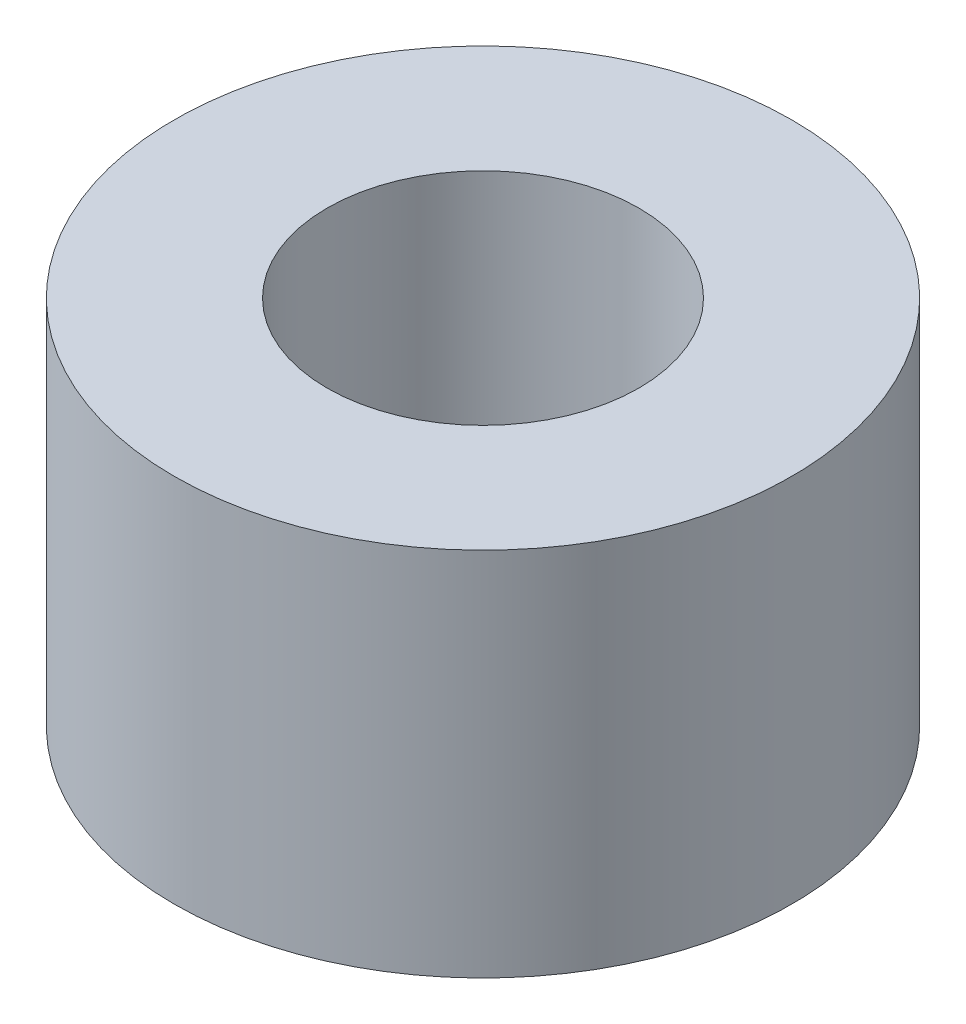
ISO-10303-21;
HEADER;
FILE_DESCRIPTION(('STEP AP214'),'2;1');
FILE_NAME('part.step','',(''),(''),'','','');
FILE_SCHEMA(('AUTOMOTIVE_DESIGN { 1 0 10303 214 1 1 1 1 }'));
ENDSEC;
DATA;
#1=APPLICATION_CONTEXT('core data for automotive mechanical design processes');
#2=APPLICATION_PROTOCOL_DEFINITION('international standard','automotive_design',2000,#1);
#3=PRODUCT_CONTEXT('',#1,'mechanical');
#4=PRODUCT('Part','Part','',(#3));
#5=PRODUCT_RELATED_PRODUCT_CATEGORY('part','',(#4));
#6=PRODUCT_DEFINITION_FORMATION('','',#4);
#7=PRODUCT_DEFINITION_CONTEXT('part definition',#1,'design');
#8=PRODUCT_DEFINITION('design','',#6,#7);
#9=PRODUCT_DEFINITION_SHAPE('','',#8);
#10=(LENGTH_UNIT() NAMED_UNIT(*) SI_UNIT(.MILLI.,.METRE.));
#11=(NAMED_UNIT(*) PLANE_ANGLE_UNIT() SI_UNIT($,.RADIAN.));
#12=(NAMED_UNIT(*) SI_UNIT($,.STERADIAN.) SOLID_ANGLE_UNIT());
#13=UNCERTAINTY_MEASURE_WITH_UNIT(LENGTH_MEASURE(1.E-05),#10,'distance_accuracy_value','');
#14=(GEOMETRIC_REPRESENTATION_CONTEXT(3) GLOBAL_UNCERTAINTY_ASSIGNED_CONTEXT((#13)) GLOBAL_UNIT_ASSIGNED_CONTEXT((#10,
#11,#12)) REPRESENTATION_CONTEXT('',''));
#15=CARTESIAN_POINT('',(0.,0.,0.));
#16=DIRECTION('',(0.,0.,1.));
#17=DIRECTION('',(1.,0.,0.));
#18=AXIS2_PLACEMENT_3D('',#15,#16,#17);
#19=CARTESIAN_POINT('',(0.,6.,0.));
#20=DIRECTION('',(0.,1.,0.));
#21=DIRECTION('',(0.,0.,1.));
#22=AXIS2_PLACEMENT_3D('',#19,#20,#21);
#23=PLANE('',#22);
#24=CARTESIAN_POINT('',(0.,6.,0.));
#25=DIRECTION('',(0.,1.,0.));
#26=DIRECTION('',(0.,0.,1.));
#27=AXIS2_PLACEMENT_3D('',#24,#25,#26);
#28=CIRCLE('',#27,5.);
#29=CARTESIAN_POINT('',(0.,6.,5.));
#30=VERTEX_POINT('',#29);
#31=EDGE_CURVE('E10',#30,#30,#28,.T.);
#32=ORIENTED_EDGE('',*,*,#31,.T.);
#33=EDGE_LOOP('',(#32));
#34=FACE_BOUND('',#33,.T.);
#35=CARTESIAN_POINT('',(0.,6.,0.));
#36=DIRECTION('',(0.,1.,0.));
#37=DIRECTION('',(0.,0.,1.));
#38=AXIS2_PLACEMENT_3D('',#35,#36,#37);
#39=CIRCLE('',#38,2.525);
#40=CARTESIAN_POINT('',(0.,6.,2.525));
#41=VERTEX_POINT('',#40);
#42=EDGE_CURVE('E41',#41,#41,#39,.T.);
#43=ORIENTED_EDGE('',*,*,#42,.F.);
#44=EDGE_LOOP('',(#43));
#45=FACE_BOUND('',#44,.T.);
#46=ADVANCED_FACE('F30',(#34,#45),#23,.T.);
#47=CARTESIAN_POINT('',(0.,0.,0.));
#48=DIRECTION('',(0.,1.,0.));
#49=DIRECTION('',(0.,0.,1.));
#50=AXIS2_PLACEMENT_3D('',#47,#48,#49);
#51=PLANE('',#50);
#52=CARTESIAN_POINT('',(0.,0.,0.));
#53=DIRECTION('',(0.,1.,0.));
#54=DIRECTION('',(0.,0.,1.));
#55=AXIS2_PLACEMENT_3D('',#52,#53,#54);
#56=CIRCLE('',#55,5.);
#57=CARTESIAN_POINT('',(0.,0.,5.));
#58=VERTEX_POINT('',#57);
#59=EDGE_CURVE('E34',#58,#58,#56,.T.);
#60=ORIENTED_EDGE('',*,*,#59,.F.);
#61=EDGE_LOOP('',(#60));
#62=FACE_BOUND('',#61,.T.);
#63=CARTESIAN_POINT('',(0.,0.,0.));
#64=DIRECTION('',(0.,1.,0.));
#65=DIRECTION('',(0.,0.,1.));
#66=AXIS2_PLACEMENT_3D('',#63,#64,#65);
#67=CIRCLE('',#66,2.525);
#68=CARTESIAN_POINT('',(0.,0.,2.525));
#69=VERTEX_POINT('',#68);
#70=EDGE_CURVE('E43',#69,#69,#67,.T.);
#71=ORIENTED_EDGE('',*,*,#70,.T.);
#72=EDGE_LOOP('',(#71));
#73=FACE_BOUND('',#72,.T.);
#74=ADVANCED_FACE('F53',(#62,#73),#51,.F.);
#75=CARTESIAN_POINT('',(0.,6.,0.));
#76=DIRECTION('',(0.,-1.,0.));
#77=DIRECTION('',(0.,0.,-1.));
#78=AXIS2_PLACEMENT_3D('',#75,#76,#77);
#79=CYLINDRICAL_SURFACE('',#78,5.);
#80=ORIENTED_EDGE('',*,*,#31,.F.);
#81=EDGE_LOOP('',(#80));
#82=FACE_BOUND('',#81,.T.);
#83=ORIENTED_EDGE('',*,*,#59,.T.);
#84=EDGE_LOOP('',(#83));
#85=FACE_BOUND('',#84,.T.);
#86=ADVANCED_FACE('F32',(#82,#85),#79,.T.);
#87=CARTESIAN_POINT('',(0.,6.,0.));
#88=DIRECTION('',(0.,-1.,0.));
#89=DIRECTION('',(0.,0.,-1.));
#90=AXIS2_PLACEMENT_3D('',#87,#88,#89);
#91=CYLINDRICAL_SURFACE('',#90,2.525);
#92=ORIENTED_EDGE('',*,*,#42,.T.);
#93=EDGE_LOOP('',(#92));
#94=FACE_BOUND('',#93,.T.);
#95=ORIENTED_EDGE('',*,*,#70,.F.);
#96=EDGE_LOOP('',(#95));
#97=FACE_BOUND('',#96,.T.);
#98=ADVANCED_FACE('F49',(#94,#97),#91,.F.);
#99=CLOSED_SHELL('',(#46,#74,#86,#98));
#100=MANIFOLD_SOLID_BREP('B2',#99);
#101=ADVANCED_BREP_SHAPE_REPRESENTATION('',(#18,#100),#14);
#102=SHAPE_DEFINITION_REPRESENTATION(#9,#101);
ENDSEC;
END-ISO-10303-21;
